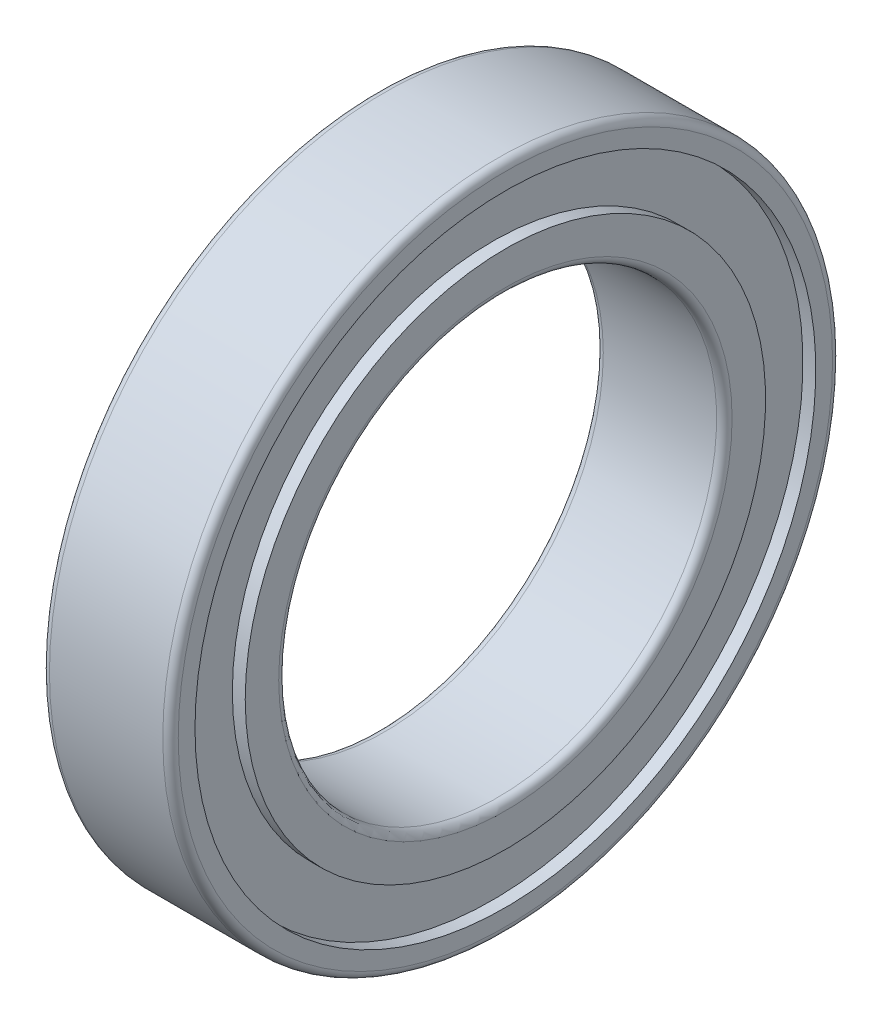
ISO-10303-21;
HEADER;
FILE_DESCRIPTION(('STEP AP214'),'2;1');
FILE_NAME('part.step','',(''),(''),'','','');
FILE_SCHEMA(('AUTOMOTIVE_DESIGN { 1 0 10303 214 1 1 1 1 }'));
ENDSEC;
DATA;
#1=APPLICATION_CONTEXT('core data for automotive mechanical design processes');
#2=APPLICATION_PROTOCOL_DEFINITION('international standard','automotive_design',2000,#1);
#3=PRODUCT_CONTEXT('',#1,'mechanical');
#4=PRODUCT('Part','Part','',(#3));
#5=PRODUCT_RELATED_PRODUCT_CATEGORY('part','',(#4));
#6=PRODUCT_DEFINITION_FORMATION('','',#4);
#7=PRODUCT_DEFINITION_CONTEXT('part definition',#1,'design');
#8=PRODUCT_DEFINITION('design','',#6,#7);
#9=PRODUCT_DEFINITION_SHAPE('','',#8);
#10=(LENGTH_UNIT() NAMED_UNIT(*) SI_UNIT(.MILLI.,.METRE.));
#11=(NAMED_UNIT(*) PLANE_ANGLE_UNIT() SI_UNIT($,.RADIAN.));
#12=(NAMED_UNIT(*) SI_UNIT($,.STERADIAN.) SOLID_ANGLE_UNIT());
#13=UNCERTAINTY_MEASURE_WITH_UNIT(LENGTH_MEASURE(1.E-05),#10,'distance_accuracy_value','');
#14=(GEOMETRIC_REPRESENTATION_CONTEXT(3) GLOBAL_UNCERTAINTY_ASSIGNED_CONTEXT((#13)) GLOBAL_UNIT_ASSIGNED_CONTEXT((#10,
#11,#12)) REPRESENTATION_CONTEXT('',''));
#15=CARTESIAN_POINT('',(0.,0.,0.));
#16=DIRECTION('',(0.,0.,1.));
#17=DIRECTION('',(1.,0.,0.));
#18=AXIS2_PLACEMENT_3D('',#15,#16,#17);
#19=CARTESIAN_POINT('',(0.,0.,0.));
#20=DIRECTION('',(-1.,0.,0.));
#21=DIRECTION('',(0.,0.,1.));
#22=AXIS2_PLACEMENT_3D('',#19,#20,#21);
#23=CYLINDRICAL_SURFACE('',#22,8.5);
#24=CARTESIAN_POINT('',(4.7,0.,0.));
#25=DIRECTION('',(-1.,0.,0.));
#26=DIRECTION('',(0.,0.,1.));
#27=AXIS2_PLACEMENT_3D('',#24,#25,#26);
#28=CIRCLE('',#27,8.5);
#29=CARTESIAN_POINT('',(4.7,0.,8.5));
#30=VERTEX_POINT('',#29);
#31=EDGE_CURVE('E268',#30,#30,#28,.T.);
#32=ORIENTED_EDGE('',*,*,#31,.F.);
#33=EDGE_LOOP('',(#32));
#34=FACE_BOUND('',#33,.T.);
#35=CARTESIAN_POINT('',(0.3,0.,0.));
#36=DIRECTION('',(1.,0.,0.));
#37=DIRECTION('',(0.,0.,-1.));
#38=AXIS2_PLACEMENT_3D('',#35,#36,#37);
#39=CIRCLE('',#38,8.5);
#40=CARTESIAN_POINT('',(0.3,0.,-8.5));
#41=VERTEX_POINT('',#40);
#42=EDGE_CURVE('E74',#41,#41,#39,.T.);
#43=ORIENTED_EDGE('',*,*,#42,.F.);
#44=EDGE_LOOP('',(#43));
#45=FACE_BOUND('',#44,.T.);
#46=ADVANCED_FACE('F16',(#34,#45),#23,.F.);
#47=CARTESIAN_POINT('',(4.7,0.,0.));
#48=DIRECTION('',(-1.,0.,0.));
#49=DIRECTION('',(0.,0.,1.));
#50=AXIS2_PLACEMENT_3D('',#47,#48,#49);
#51=TOROIDAL_SURFACE('',#50,8.8,0.3);
#52=CARTESIAN_POINT('',(5.,0.,0.));
#53=DIRECTION('',(1.,0.,0.));
#54=DIRECTION('',(0.,0.,1.));
#55=AXIS2_PLACEMENT_3D('',#52,#53,#54);
#56=CIRCLE('',#55,8.8);
#57=CARTESIAN_POINT('',(5.,0.,8.8));
#58=VERTEX_POINT('',#57);
#59=CARTESIAN_POINT('',(5.,0.,-8.8));
#60=VERTEX_POINT('',#59);
#61=EDGE_CURVE('E68',#58,#60,#56,.T.);
#62=ORIENTED_EDGE('',*,*,#61,.T.);
#63=CARTESIAN_POINT('',(5.,0.,0.));
#64=DIRECTION('',(1.,0.,0.));
#65=DIRECTION('',(0.,0.,-1.));
#66=AXIS2_PLACEMENT_3D('',#63,#64,#65);
#67=CIRCLE('',#66,8.8);
#68=EDGE_CURVE('E64',#60,#58,#67,.T.);
#69=ORIENTED_EDGE('',*,*,#68,.T.);
#70=EDGE_LOOP('',(#62,#69));
#71=FACE_BOUND('',#70,.T.);
#72=ORIENTED_EDGE('',*,*,#31,.T.);
#73=EDGE_LOOP('',(#72));
#74=FACE_BOUND('',#73,.T.);
#75=ADVANCED_FACE('F69',(#71,#74),#51,.T.);
#76=CARTESIAN_POINT('',(0.3,0.,0.));
#77=DIRECTION('',(1.,0.,0.));
#78=DIRECTION('',(0.,0.,-1.));
#79=AXIS2_PLACEMENT_3D('',#76,#77,#78);
#80=TOROIDAL_SURFACE('',#79,8.8,0.3);
#81=CARTESIAN_POINT('',(0.,0.,0.));
#82=DIRECTION('',(-1.,0.,0.));
#83=DIRECTION('',(0.,0.,-1.));
#84=AXIS2_PLACEMENT_3D('',#81,#82,#83);
#85=CIRCLE('',#84,8.8);
#86=CARTESIAN_POINT('',(0.,0.,-8.8));
#87=VERTEX_POINT('',#86);
#88=CARTESIAN_POINT('',(0.,0.,8.8));
#89=VERTEX_POINT('',#88);
#90=EDGE_CURVE('E79',#87,#89,#85,.T.);
#91=ORIENTED_EDGE('',*,*,#90,.T.);
#92=CARTESIAN_POINT('',(0.,0.,0.));
#93=DIRECTION('',(-1.,0.,0.));
#94=DIRECTION('',(0.,0.,1.));
#95=AXIS2_PLACEMENT_3D('',#92,#93,#94);
#96=CIRCLE('',#95,8.8);
#97=EDGE_CURVE('E233',#89,#87,#96,.T.);
#98=ORIENTED_EDGE('',*,*,#97,.T.);
#99=EDGE_LOOP('',(#91,#98));
#100=FACE_BOUND('',#99,.T.);
#101=ORIENTED_EDGE('',*,*,#42,.T.);
#102=EDGE_LOOP('',(#101));
#103=FACE_BOUND('',#102,.T.);
#104=ADVANCED_FACE('F100',(#100,#103),#80,.T.);
#105=CARTESIAN_POINT('',(5.,8.5,0.));
#106=DIRECTION('',(-1.,0.,0.));
#107=DIRECTION('',(0.,0.,1.));
#108=AXIS2_PLACEMENT_3D('',#105,#106,#107);
#109=PLANE('',#108);
#110=CARTESIAN_POINT('',(5.,0.,0.));
#111=DIRECTION('',(-1.,0.,0.));
#112=DIRECTION('',(0.,0.,1.));
#113=AXIS2_PLACEMENT_3D('',#110,#111,#112);
#114=CIRCLE('',#113,10.1);
#115=CARTESIAN_POINT('',(5.,0.,10.1));
#116=VERTEX_POINT('',#115);
#117=EDGE_CURVE('E242',#116,#116,#114,.T.);
#118=ORIENTED_EDGE('',*,*,#117,.F.);
#119=EDGE_LOOP('',(#118));
#120=FACE_BOUND('',#119,.T.);
#121=ORIENTED_EDGE('',*,*,#61,.F.);
#122=ORIENTED_EDGE('',*,*,#68,.F.);
#123=EDGE_LOOP('',(#121,#122));
#124=FACE_BOUND('',#123,.T.);
#125=ADVANCED_FACE('F77',(#120,#124),#109,.F.);
#126=CARTESIAN_POINT('',(0.,8.5,0.));
#127=DIRECTION('',(1.,0.,0.));
#128=DIRECTION('',(0.,0.,-1.));
#129=AXIS2_PLACEMENT_3D('',#126,#127,#128);
#130=PLANE('',#129);
#131=CARTESIAN_POINT('',(0.,0.,0.));
#132=DIRECTION('',(-1.,0.,0.));
#133=DIRECTION('',(0.,0.,1.));
#134=AXIS2_PLACEMENT_3D('',#131,#132,#133);
#135=CIRCLE('',#134,10.1);
#136=CARTESIAN_POINT('',(0.,0.,10.1));
#137=VERTEX_POINT('',#136);
#138=EDGE_CURVE('E248',#137,#137,#135,.F.);
#139=ORIENTED_EDGE('',*,*,#138,.F.);
#140=EDGE_LOOP('',(#139));
#141=FACE_BOUND('',#140,.T.);
#142=ORIENTED_EDGE('',*,*,#90,.F.);
#143=ORIENTED_EDGE('',*,*,#97,.F.);
#144=EDGE_LOOP('',(#142,#143));
#145=FACE_BOUND('',#144,.T.);
#146=ADVANCED_FACE('F99',(#141,#145),#130,.F.);
#147=CARTESIAN_POINT('',(0.,0.,0.));
#148=DIRECTION('',(-1.,0.,0.));
#149=DIRECTION('',(0.,0.,1.));
#150=AXIS2_PLACEMENT_3D('',#147,#148,#149);
#151=CYLINDRICAL_SURFACE('',#150,10.1);
#152=CARTESIAN_POINT('',(4.5,0.,0.));
#153=DIRECTION('',(-1.,0.,0.));
#154=DIRECTION('',(0.,0.,1.));
#155=AXIS2_PLACEMENT_3D('',#152,#153,#154);
#156=CIRCLE('',#155,10.1);
#157=CARTESIAN_POINT('',(4.5,0.,10.1));
#158=VERTEX_POINT('',#157);
#159=EDGE_CURVE('E281',#158,#158,#156,.F.);
#160=ORIENTED_EDGE('',*,*,#159,.T.);
#161=EDGE_LOOP('',(#160));
#162=FACE_BOUND('',#161,.T.);
#163=ORIENTED_EDGE('',*,*,#117,.T.);
#164=EDGE_LOOP('',(#163));
#165=FACE_BOUND('',#164,.T.);
#166=ADVANCED_FACE('F353',(#162,#165),#151,.T.);
#167=CARTESIAN_POINT('',(0.,0.,0.));
#168=DIRECTION('',(-1.,0.,0.));
#169=DIRECTION('',(0.,0.,1.));
#170=AXIS2_PLACEMENT_3D('',#167,#168,#169);
#171=CYLINDRICAL_SURFACE('',#170,10.1);
#172=ORIENTED_EDGE('',*,*,#138,.T.);
#173=EDGE_LOOP('',(#172));
#174=FACE_BOUND('',#173,.T.);
#175=CARTESIAN_POINT('',(0.5,0.,0.));
#176=DIRECTION('',(-1.,0.,0.));
#177=DIRECTION('',(0.,0.,1.));
#178=AXIS2_PLACEMENT_3D('',#175,#176,#177);
#179=CIRCLE('',#178,10.1);
#180=CARTESIAN_POINT('',(0.5,0.,10.1));
#181=VERTEX_POINT('',#180);
#182=EDGE_CURVE('E277',#181,#181,#179,.T.);
#183=ORIENTED_EDGE('',*,*,#182,.T.);
#184=EDGE_LOOP('',(#183));
#185=FACE_BOUND('',#184,.T.);
#186=ADVANCED_FACE('F360',(#174,#185),#171,.T.);
#187=CARTESIAN_POINT('',(4.5,12.05,0.));
#188=DIRECTION('',(-1.,0.,0.));
#189=DIRECTION('',(0.,0.,1.));
#190=AXIS2_PLACEMENT_3D('',#187,#188,#189);
#191=PLANE('',#190);
#192=ORIENTED_EDGE('',*,*,#159,.F.);
#193=EDGE_LOOP('',(#192));
#194=FACE_BOUND('',#193,.T.);
#195=CARTESIAN_POINT('',(4.5,0.,0.));
#196=DIRECTION('',(-1.,0.,0.));
#197=DIRECTION('',(0.,0.,1.));
#198=AXIS2_PLACEMENT_3D('',#195,#196,#197);
#199=CIRCLE('',#198,12.05);
#200=CARTESIAN_POINT('',(4.5,0.,12.05));
#201=VERTEX_POINT('',#200);
#202=EDGE_CURVE('E273',#201,#201,#199,.F.);
#203=ORIENTED_EDGE('',*,*,#202,.T.);
#204=EDGE_LOOP('',(#203));
#205=FACE_BOUND('',#204,.T.);
#206=ADVANCED_FACE('F367',(#194,#205),#191,.F.);
#207=CARTESIAN_POINT('',(0.5,10.1,0.));
#208=DIRECTION('',(1.,0.,0.));
#209=DIRECTION('',(0.,0.,-1.));
#210=AXIS2_PLACEMENT_3D('',#207,#208,#209);
#211=PLANE('',#210);
#212=CARTESIAN_POINT('',(0.5,0.,0.));
#213=DIRECTION('',(-1.,0.,0.));
#214=DIRECTION('',(0.,0.,1.));
#215=AXIS2_PLACEMENT_3D('',#212,#213,#214);
#216=CIRCLE('',#215,12.05);
#217=CARTESIAN_POINT('',(0.5,0.,12.05));
#218=VERTEX_POINT('',#217);
#219=EDGE_CURVE('E265',#218,#218,#216,.T.);
#220=ORIENTED_EDGE('',*,*,#219,.T.);
#221=EDGE_LOOP('',(#220));
#222=FACE_BOUND('',#221,.T.);
#223=ORIENTED_EDGE('',*,*,#182,.F.);
#224=EDGE_LOOP('',(#223));
#225=FACE_BOUND('',#224,.T.);
#226=ADVANCED_FACE('F375',(#222,#225),#211,.F.);
#227=CARTESIAN_POINT('',(0.,0.,0.));
#228=DIRECTION('',(-1.,0.,0.));
#229=DIRECTION('',(0.,0.,1.));
#230=AXIS2_PLACEMENT_3D('',#227,#228,#229);
#231=CYLINDRICAL_SURFACE('',#230,12.05);
#232=CARTESIAN_POINT('',(5.,0.,0.));
#233=DIRECTION('',(-1.,0.,0.));
#234=DIRECTION('',(0.,0.,1.));
#235=AXIS2_PLACEMENT_3D('',#232,#233,#234);
#236=CIRCLE('',#235,12.05);
#237=CARTESIAN_POINT('',(5.,0.,12.05));
#238=VERTEX_POINT('',#237);
#239=EDGE_CURVE('E259',#238,#238,#236,.F.);
#240=ORIENTED_EDGE('',*,*,#239,.T.);
#241=EDGE_LOOP('',(#240));
#242=FACE_BOUND('',#241,.T.);
#243=ORIENTED_EDGE('',*,*,#202,.F.);
#244=EDGE_LOOP('',(#243));
#245=FACE_BOUND('',#244,.T.);
#246=ADVANCED_FACE('F383',(#242,#245),#231,.F.);
#247=CARTESIAN_POINT('',(0.,0.,0.));
#248=DIRECTION('',(-1.,0.,0.));
#249=DIRECTION('',(0.,0.,1.));
#250=AXIS2_PLACEMENT_3D('',#247,#248,#249);
#251=CYLINDRICAL_SURFACE('',#250,12.05);
#252=ORIENTED_EDGE('',*,*,#219,.F.);
#253=EDGE_LOOP('',(#252));
#254=FACE_BOUND('',#253,.T.);
#255=CARTESIAN_POINT('',(0.,0.,0.));
#256=DIRECTION('',(-1.,0.,0.));
#257=DIRECTION('',(0.,0.,1.));
#258=AXIS2_PLACEMENT_3D('',#255,#256,#257);
#259=CIRCLE('',#258,12.05);
#260=CARTESIAN_POINT('',(0.,0.,12.05));
#261=VERTEX_POINT('',#260);
#262=EDGE_CURVE('E257',#261,#261,#259,.T.);
#263=ORIENTED_EDGE('',*,*,#262,.T.);
#264=EDGE_LOOP('',(#263));
#265=FACE_BOUND('',#264,.T.);
#266=ADVANCED_FACE('F201',(#254,#265),#251,.F.);
#267=CARTESIAN_POINT('',(5.,13.,0.));
#268=DIRECTION('',(-1.,0.,0.));
#269=DIRECTION('',(0.,0.,1.));
#270=AXIS2_PLACEMENT_3D('',#267,#268,#269);
#271=PLANE('',#270);
#272=ORIENTED_EDGE('',*,*,#239,.F.);
#273=EDGE_LOOP('',(#272));
#274=FACE_BOUND('',#273,.T.);
#275=CARTESIAN_POINT('',(5.,0.,0.));
#276=DIRECTION('',(-1.,0.,0.));
#277=DIRECTION('',(0.,0.,1.));
#278=AXIS2_PLACEMENT_3D('',#275,#276,#277);
#279=CIRCLE('',#278,12.7);
#280=CARTESIAN_POINT('',(5.,0.,12.7));
#281=VERTEX_POINT('',#280);
#282=CARTESIAN_POINT('',(5.,0.,-12.7));
#283=VERTEX_POINT('',#282);
#284=EDGE_CURVE('E187',#281,#283,#279,.T.);
#285=ORIENTED_EDGE('',*,*,#284,.F.);
#286=CARTESIAN_POINT('',(5.,0.,0.));
#287=DIRECTION('',(-1.,0.,0.));
#288=DIRECTION('',(0.,0.,-1.));
#289=AXIS2_PLACEMENT_3D('',#286,#287,#288);
#290=CIRCLE('',#289,12.7);
#291=EDGE_CURVE('E256',#283,#281,#290,.T.);
#292=ORIENTED_EDGE('',*,*,#291,.F.);
#293=EDGE_LOOP('',(#285,#292));
#294=FACE_BOUND('',#293,.T.);
#295=ADVANCED_FACE('F192',(#274,#294),#271,.F.);
#296=CARTESIAN_POINT('',(0.,12.05,0.));
#297=DIRECTION('',(1.,0.,0.));
#298=DIRECTION('',(0.,0.,-1.));
#299=AXIS2_PLACEMENT_3D('',#296,#297,#298);
#300=PLANE('',#299);
#301=ORIENTED_EDGE('',*,*,#262,.F.);
#302=EDGE_LOOP('',(#301));
#303=FACE_BOUND('',#302,.T.);
#304=CARTESIAN_POINT('',(0.,0.,0.));
#305=DIRECTION('',(1.,0.,0.));
#306=DIRECTION('',(0.,0.,-1.));
#307=AXIS2_PLACEMENT_3D('',#304,#305,#306);
#308=CIRCLE('',#307,12.7);
#309=CARTESIAN_POINT('',(0.,0.,-12.7));
#310=VERTEX_POINT('',#309);
#311=CARTESIAN_POINT('',(0.,0.,12.7));
#312=VERTEX_POINT('',#311);
#313=EDGE_CURVE('E157',#310,#312,#308,.T.);
#314=ORIENTED_EDGE('',*,*,#313,.F.);
#315=CARTESIAN_POINT('',(0.,0.,0.));
#316=DIRECTION('',(1.,0.,0.));
#317=DIRECTION('',(0.,0.,1.));
#318=AXIS2_PLACEMENT_3D('',#315,#316,#317);
#319=CIRCLE('',#318,12.7);
#320=EDGE_CURVE('E39',#312,#310,#319,.T.);
#321=ORIENTED_EDGE('',*,*,#320,.F.);
#322=EDGE_LOOP('',(#314,#321));
#323=FACE_BOUND('',#322,.T.);
#324=ADVANCED_FACE('F143',(#303,#323),#300,.F.);
#325=CARTESIAN_POINT('',(4.7,0.,0.));
#326=DIRECTION('',(-1.,0.,0.));
#327=DIRECTION('',(0.,0.,1.));
#328=AXIS2_PLACEMENT_3D('',#325,#326,#327);
#329=TOROIDAL_SURFACE('',#328,12.7,0.3);
#330=CARTESIAN_POINT('',(4.7,0.,0.));
#331=DIRECTION('',(-1.,0.,0.));
#332=DIRECTION('',(0.,0.,1.));
#333=AXIS2_PLACEMENT_3D('',#330,#331,#332);
#334=CIRCLE('',#333,13.);
#335=CARTESIAN_POINT('',(4.7,0.,13.));
#336=VERTEX_POINT('',#335);
#337=EDGE_CURVE('E27',#336,#336,#334,.T.);
#338=ORIENTED_EDGE('',*,*,#337,.F.);
#339=EDGE_LOOP('',(#338));
#340=FACE_BOUND('',#339,.T.);
#341=ORIENTED_EDGE('',*,*,#284,.T.);
#342=ORIENTED_EDGE('',*,*,#291,.T.);
#343=EDGE_LOOP('',(#341,#342));
#344=FACE_BOUND('',#343,.T.);
#345=ADVANCED_FACE('F131',(#340,#344),#329,.T.);
#346=CARTESIAN_POINT('',(0.3,0.,0.));
#347=DIRECTION('',(1.,0.,0.));
#348=DIRECTION('',(0.,0.,-1.));
#349=AXIS2_PLACEMENT_3D('',#346,#347,#348);
#350=TOROIDAL_SURFACE('',#349,12.7,0.3);
#351=CARTESIAN_POINT('',(0.3,0.,0.));
#352=DIRECTION('',(-1.,0.,0.));
#353=DIRECTION('',(0.,0.,1.));
#354=AXIS2_PLACEMENT_3D('',#351,#352,#353);
#355=CIRCLE('',#354,13.);
#356=CARTESIAN_POINT('',(0.3,0.,13.));
#357=VERTEX_POINT('',#356);
#358=EDGE_CURVE('E11',#357,#357,#355,.F.);
#359=ORIENTED_EDGE('',*,*,#358,.F.);
#360=EDGE_LOOP('',(#359));
#361=FACE_BOUND('',#360,.T.);
#362=ORIENTED_EDGE('',*,*,#313,.T.);
#363=ORIENTED_EDGE('',*,*,#320,.T.);
#364=EDGE_LOOP('',(#362,#363));
#365=FACE_BOUND('',#364,.T.);
#366=ADVANCED_FACE('F142',(#361,#365),#350,.T.);
#367=CARTESIAN_POINT('',(0.,0.,0.));
#368=DIRECTION('',(-1.,0.,0.));
#369=DIRECTION('',(0.,0.,1.));
#370=AXIS2_PLACEMENT_3D('',#367,#368,#369);
#371=CYLINDRICAL_SURFACE('',#370,13.);
#372=ORIENTED_EDGE('',*,*,#358,.T.);
#373=EDGE_LOOP('',(#372));
#374=FACE_BOUND('',#373,.T.);
#375=ORIENTED_EDGE('',*,*,#337,.T.);
#376=EDGE_LOOP('',(#375));
#377=FACE_BOUND('',#376,.T.);
#378=ADVANCED_FACE('F296',(#374,#377),#371,.T.);
#379=CLOSED_SHELL('',(#46,#75,#104,#125,#146,#166,#186,#206,#226,#246,#266,#295,#324,#345,#366,#378));
#380=MANIFOLD_SOLID_BREP('B1',#379);
#381=ADVANCED_BREP_SHAPE_REPRESENTATION('',(#18,#380),#14);
#382=SHAPE_DEFINITION_REPRESENTATION(#9,#381);
ENDSEC;
END-ISO-10303-21;
